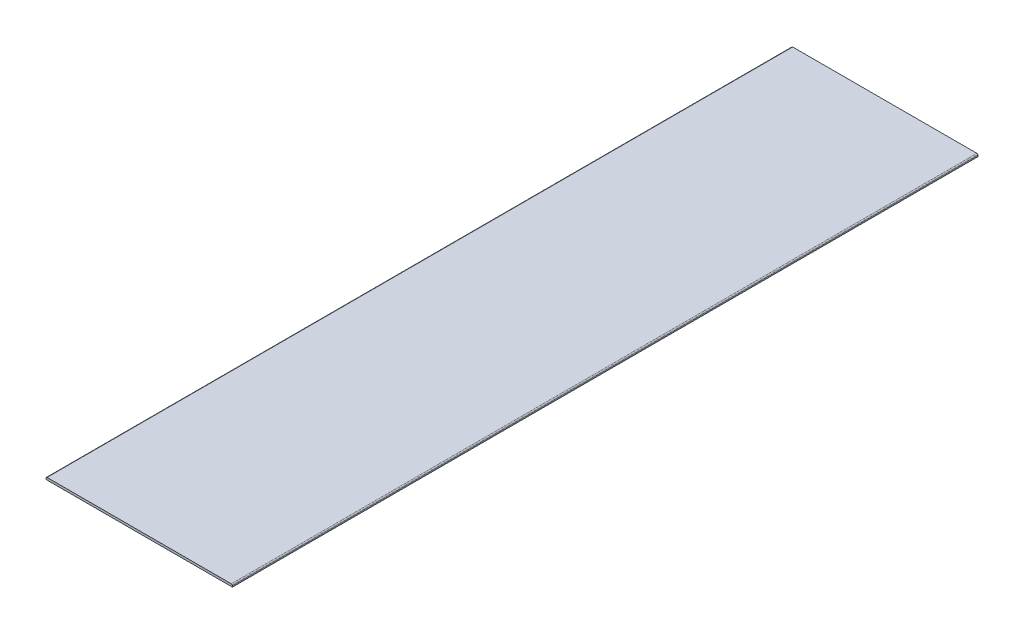
ISO-10303-21;
HEADER;
FILE_DESCRIPTION(('STEP AP214'),'2;1');
FILE_NAME('part.step','',(''),(''),'','','');
FILE_SCHEMA(('AUTOMOTIVE_DESIGN { 1 0 10303 214 1 1 1 1 }'));
ENDSEC;
DATA;
#1=APPLICATION_CONTEXT('core data for automotive mechanical design processes');
#2=APPLICATION_PROTOCOL_DEFINITION('international standard','automotive_design',2000,#1);
#3=PRODUCT_CONTEXT('',#1,'mechanical');
#4=PRODUCT('Part','Part','',(#3));
#5=PRODUCT_RELATED_PRODUCT_CATEGORY('part','',(#4));
#6=PRODUCT_DEFINITION_FORMATION('','',#4);
#7=PRODUCT_DEFINITION_CONTEXT('part definition',#1,'design');
#8=PRODUCT_DEFINITION('design','',#6,#7);
#9=PRODUCT_DEFINITION_SHAPE('','',#8);
#10=(LENGTH_UNIT() NAMED_UNIT(*) SI_UNIT(.MILLI.,.METRE.));
#11=(NAMED_UNIT(*) PLANE_ANGLE_UNIT() SI_UNIT($,.RADIAN.));
#12=(NAMED_UNIT(*) SI_UNIT($,.STERADIAN.) SOLID_ANGLE_UNIT());
#13=UNCERTAINTY_MEASURE_WITH_UNIT(LENGTH_MEASURE(1.E-05),#10,'distance_accuracy_value','');
#14=(GEOMETRIC_REPRESENTATION_CONTEXT(3) GLOBAL_UNCERTAINTY_ASSIGNED_CONTEXT((#13)) GLOBAL_UNIT_ASSIGNED_CONTEXT((#10,
#11,#12)) REPRESENTATION_CONTEXT('',''));
#15=CARTESIAN_POINT('',(0.,0.,0.));
#16=DIRECTION('',(0.,0.,1.));
#17=DIRECTION('',(1.,0.,0.));
#18=AXIS2_PLACEMENT_3D('',#15,#16,#17);
#19=CARTESIAN_POINT('',(504.825,3.175,4680.9152));
#20=DIRECTION('',(0.,0.,-1.));
#21=DIRECTION('',(-1.,0.,0.));
#22=AXIS2_PLACEMENT_3D('',#19,#20,#21);
#23=CYLINDRICAL_SURFACE('',#22,3.175);
#24=DIRECTION('',(0.,0.,-1.));
#25=VECTOR('',#24,1.);
#26=CARTESIAN_POINT('',(508.,3.17499999999746,0.));
#27=LINE('',#26,#25);
#28=CARTESIAN_POINT('',(508.,3.17499999999873,0.));
#29=VERTEX_POINT('',#28);
#30=CARTESIAN_POINT('',(508.,3.17499999999873,2032.));
#31=VERTEX_POINT('',#30);
#32=EDGE_CURVE('E77',#29,#31,#27,.F.);
#33=ORIENTED_EDGE('',*,*,#32,.F.);
#34=CARTESIAN_POINT('',(504.825,3.175,0.));
#35=DIRECTION('',(0.,0.,-1.));
#36=DIRECTION('',(-1.,0.,0.));
#37=AXIS2_PLACEMENT_3D('',#34,#35,#36);
#38=CIRCLE('',#37,3.175);
#39=CARTESIAN_POINT('',(504.825,6.35,0.));
#40=VERTEX_POINT('',#39);
#41=EDGE_CURVE('E107',#29,#40,#38,.F.);
#42=ORIENTED_EDGE('',*,*,#41,.T.);
#43=DIRECTION('',(0.,0.,1.));
#44=VECTOR('',#43,1.);
#45=CARTESIAN_POINT('',(504.825,6.35,0.));
#46=LINE('',#45,#44);
#47=CARTESIAN_POINT('',(504.825,6.35,2032.));
#48=VERTEX_POINT('',#47);
#49=EDGE_CURVE('E78',#48,#40,#46,.F.);
#50=ORIENTED_EDGE('',*,*,#49,.F.);
#51=CARTESIAN_POINT('',(504.825,3.175,2032.));
#52=DIRECTION('',(0.,0.,-1.));
#53=DIRECTION('',(-1.,0.,0.));
#54=AXIS2_PLACEMENT_3D('',#51,#52,#53);
#55=CIRCLE('',#54,3.175);
#56=EDGE_CURVE('E90',#31,#48,#55,.F.);
#57=ORIENTED_EDGE('',*,*,#56,.F.);
#58=EDGE_LOOP('',(#33,#42,#50,#57));
#59=FACE_BOUND('',#58,.T.);
#60=ADVANCED_FACE('F16',(#59),#23,.T.);
#61=CARTESIAN_POINT('',(508.,6.35,0.));
#62=DIRECTION('',(0.,1.,0.));
#63=DIRECTION('',(0.,0.,1.));
#64=AXIS2_PLACEMENT_3D('',#61,#62,#63);
#65=PLANE('',#64);
#66=DIRECTION('',(1.,0.,0.));
#67=VECTOR('',#66,1.);
#68=CARTESIAN_POINT('',(0.,6.35,2032.));
#69=LINE('',#68,#67);
#70=CARTESIAN_POINT('',(3.175,6.35,2032.));
#71=VERTEX_POINT('',#70);
#72=EDGE_CURVE('E71',#48,#71,#69,.F.);
#73=ORIENTED_EDGE('',*,*,#72,.F.);
#74=ORIENTED_EDGE('',*,*,#49,.T.);
#75=DIRECTION('',(1.,0.,0.));
#76=VECTOR('',#75,1.);
#77=CARTESIAN_POINT('',(0.,6.35,0.));
#78=LINE('',#77,#76);
#79=CARTESIAN_POINT('',(3.175,6.35,0.));
#80=VERTEX_POINT('',#79);
#81=EDGE_CURVE('E74',#40,#80,#78,.F.);
#82=ORIENTED_EDGE('',*,*,#81,.T.);
#83=DIRECTION('',(0.,0.,-1.));
#84=VECTOR('',#83,1.);
#85=CARTESIAN_POINT('',(3.175,6.35,4680.9152));
#86=LINE('',#85,#84);
#87=EDGE_CURVE('E66',#71,#80,#86,.T.);
#88=ORIENTED_EDGE('',*,*,#87,.F.);
#89=EDGE_LOOP('',(#73,#74,#82,#88));
#90=FACE_BOUND('',#89,.T.);
#91=ADVANCED_FACE('F68',(#90),#65,.T.);
#92=CARTESIAN_POINT('',(3.175,3.175,4680.9152));
#93=DIRECTION('',(0.,0.,-1.));
#94=DIRECTION('',(-1.,0.,0.));
#95=AXIS2_PLACEMENT_3D('',#92,#93,#94);
#96=CYLINDRICAL_SURFACE('',#95,3.175);
#97=ORIENTED_EDGE('',*,*,#87,.T.);
#98=CARTESIAN_POINT('',(3.175,3.175,0.));
#99=DIRECTION('',(0.,0.,-1.));
#100=DIRECTION('',(-1.,0.,0.));
#101=AXIS2_PLACEMENT_3D('',#98,#99,#100);
#102=CIRCLE('',#101,3.175);
#103=CARTESIAN_POINT('',(0.,3.17499999999873,0.));
#104=VERTEX_POINT('',#103);
#105=EDGE_CURVE('E121',#80,#104,#102,.F.);
#106=ORIENTED_EDGE('',*,*,#105,.T.);
#107=DIRECTION('',(0.,0.,1.));
#108=VECTOR('',#107,1.);
#109=CARTESIAN_POINT('',(0.,3.17499999999746,0.));
#110=LINE('',#109,#108);
#111=CARTESIAN_POINT('',(0.,3.17499999999873,2032.));
#112=VERTEX_POINT('',#111);
#113=EDGE_CURVE('E83',#112,#104,#110,.F.);
#114=ORIENTED_EDGE('',*,*,#113,.F.);
#115=CARTESIAN_POINT('',(3.175,3.175,2032.));
#116=DIRECTION('',(0.,0.,-1.));
#117=DIRECTION('',(-1.,0.,0.));
#118=AXIS2_PLACEMENT_3D('',#115,#116,#117);
#119=CIRCLE('',#118,3.175);
#120=EDGE_CURVE('E19',#71,#112,#119,.F.);
#121=ORIENTED_EDGE('',*,*,#120,.F.);
#122=EDGE_LOOP('',(#97,#106,#114,#121));
#123=FACE_BOUND('',#122,.T.);
#124=ADVANCED_FACE('F82',(#123),#96,.T.);
#125=CARTESIAN_POINT('',(508.,0.,0.));
#126=DIRECTION('',(1.,0.,0.));
#127=DIRECTION('',(0.,0.,-1.));
#128=AXIS2_PLACEMENT_3D('',#125,#126,#127);
#129=PLANE('',#128);
#130=DIRECTION('',(0.,1.,0.));
#131=VECTOR('',#130,1.);
#132=CARTESIAN_POINT('',(508.,0.,0.));
#133=LINE('',#132,#131);
#134=CARTESIAN_POINT('',(508.,0.,0.));
#135=VERTEX_POINT('',#134);
#136=EDGE_CURVE('E101',#135,#29,#133,.T.);
#137=ORIENTED_EDGE('',*,*,#136,.T.);
#138=ORIENTED_EDGE('',*,*,#32,.T.);
#139=DIRECTION('',(0.,1.,0.));
#140=VECTOR('',#139,1.);
#141=CARTESIAN_POINT('',(508.,0.,2032.));
#142=LINE('',#141,#140);
#143=CARTESIAN_POINT('',(508.,0.,2032.));
#144=VERTEX_POINT('',#143);
#145=EDGE_CURVE('E86',#144,#31,#142,.T.);
#146=ORIENTED_EDGE('',*,*,#145,.F.);
#147=DIRECTION('',(0.,0.,-1.));
#148=VECTOR('',#147,1.);
#149=CARTESIAN_POINT('',(508.,0.,0.));
#150=LINE('',#149,#148);
#151=EDGE_CURVE('E97',#135,#144,#150,.F.);
#152=ORIENTED_EDGE('',*,*,#151,.F.);
#153=EDGE_LOOP('',(#137,#138,#146,#152));
#154=FACE_BOUND('',#153,.T.);
#155=ADVANCED_FACE('F136',(#154),#129,.T.);
#156=CARTESIAN_POINT('',(0.,0.,2032.));
#157=DIRECTION('',(0.,0.,1.));
#158=DIRECTION('',(1.,0.,0.));
#159=AXIS2_PLACEMENT_3D('',#156,#157,#158);
#160=PLANE('',#159);
#161=ORIENTED_EDGE('',*,*,#145,.T.);
#162=ORIENTED_EDGE('',*,*,#56,.T.);
#163=ORIENTED_EDGE('',*,*,#72,.T.);
#164=ORIENTED_EDGE('',*,*,#120,.T.);
#165=DIRECTION('',(0.,1.,0.));
#166=VECTOR('',#165,1.);
#167=CARTESIAN_POINT('',(0.,6.35,2032.));
#168=LINE('',#167,#166);
#169=CARTESIAN_POINT('',(0.,0.,2032.));
#170=VERTEX_POINT('',#169);
#171=EDGE_CURVE('E108',#170,#112,#168,.T.);
#172=ORIENTED_EDGE('',*,*,#171,.F.);
#173=DIRECTION('',(1.,0.,0.));
#174=VECTOR('',#173,1.);
#175=CARTESIAN_POINT('',(0.,0.,2032.));
#176=LINE('',#175,#174);
#177=EDGE_CURVE('E100',#144,#170,#176,.F.);
#178=ORIENTED_EDGE('',*,*,#177,.F.);
#179=EDGE_LOOP('',(#161,#162,#163,#164,#172,#178));
#180=FACE_BOUND('',#179,.T.);
#181=ADVANCED_FACE('F88',(#180),#160,.T.);
#182=CARTESIAN_POINT('',(0.,6.35,0.));
#183=DIRECTION('',(-1.,0.,0.));
#184=DIRECTION('',(0.,0.,1.));
#185=AXIS2_PLACEMENT_3D('',#182,#183,#184);
#186=PLANE('',#185);
#187=ORIENTED_EDGE('',*,*,#171,.T.);
#188=ORIENTED_EDGE('',*,*,#113,.T.);
#189=DIRECTION('',(0.,1.,0.));
#190=VECTOR('',#189,1.);
#191=CARTESIAN_POINT('',(0.,0.,0.));
#192=LINE('',#191,#190);
#193=CARTESIAN_POINT('',(0.,0.,0.));
#194=VERTEX_POINT('',#193);
#195=EDGE_CURVE('E34',#104,#194,#192,.F.);
#196=ORIENTED_EDGE('',*,*,#195,.T.);
#197=DIRECTION('',(0.,0.,-1.));
#198=VECTOR('',#197,1.);
#199=CARTESIAN_POINT('',(0.,0.,0.));
#200=LINE('',#199,#198);
#201=EDGE_CURVE('E25',#170,#194,#200,.T.);
#202=ORIENTED_EDGE('',*,*,#201,.F.);
#203=EDGE_LOOP('',(#187,#188,#196,#202));
#204=FACE_BOUND('',#203,.T.);
#205=ADVANCED_FACE('F152',(#204),#186,.T.);
#206=CARTESIAN_POINT('',(0.,0.,0.));
#207=DIRECTION('',(0.,0.,1.));
#208=DIRECTION('',(1.,0.,0.));
#209=AXIS2_PLACEMENT_3D('',#206,#207,#208);
#210=PLANE('',#209);
#211=DIRECTION('',(1.,0.,0.));
#212=VECTOR('',#211,1.);
#213=CARTESIAN_POINT('',(0.,0.,0.));
#214=LINE('',#213,#212);
#215=EDGE_CURVE('E11',#194,#135,#214,.T.);
#216=ORIENTED_EDGE('',*,*,#215,.F.);
#217=ORIENTED_EDGE('',*,*,#195,.F.);
#218=ORIENTED_EDGE('',*,*,#105,.F.);
#219=ORIENTED_EDGE('',*,*,#81,.F.);
#220=ORIENTED_EDGE('',*,*,#41,.F.);
#221=ORIENTED_EDGE('',*,*,#136,.F.);
#222=EDGE_LOOP('',(#216,#217,#218,#219,#220,#221));
#223=FACE_BOUND('',#222,.T.);
#224=ADVANCED_FACE('F138',(#223),#210,.F.);
#225=CARTESIAN_POINT('',(0.,0.,0.));
#226=DIRECTION('',(0.,-1.,0.));
#227=DIRECTION('',(0.,0.,-1.));
#228=AXIS2_PLACEMENT_3D('',#225,#226,#227);
#229=PLANE('',#228);
#230=ORIENTED_EDGE('',*,*,#201,.T.);
#231=ORIENTED_EDGE('',*,*,#215,.T.);
#232=ORIENTED_EDGE('',*,*,#151,.T.);
#233=ORIENTED_EDGE('',*,*,#177,.T.);
#234=EDGE_LOOP('',(#230,#231,#232,#233));
#235=FACE_BOUND('',#234,.T.);
#236=ADVANCED_FACE('F145',(#235),#229,.T.);
#237=CLOSED_SHELL('',(#60,#91,#124,#155,#181,#205,#224,#236));
#238=MANIFOLD_SOLID_BREP('B1',#237);
#239=ADVANCED_BREP_SHAPE_REPRESENTATION('',(#18,#238),#14);
#240=SHAPE_DEFINITION_REPRESENTATION(#9,#239);
ENDSEC;
END-ISO-10303-21;
